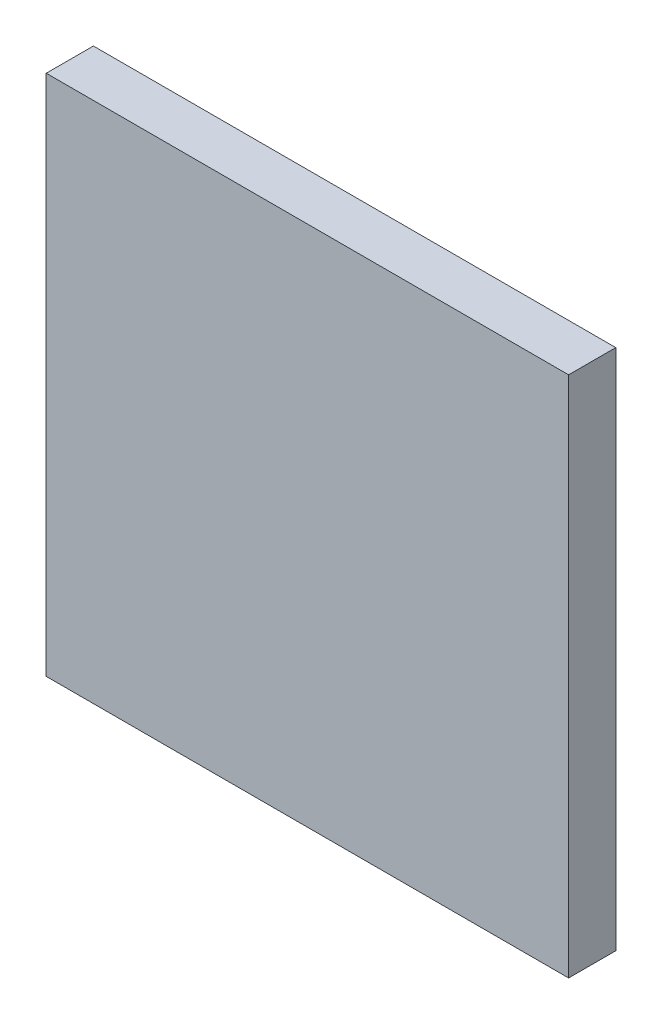
ISO-10303-21;
HEADER;
FILE_DESCRIPTION(('STEP AP214'),'2;1');
FILE_NAME('part.step','',(''),(''),'','','');
FILE_SCHEMA(('AUTOMOTIVE_DESIGN { 1 0 10303 214 1 1 1 1 }'));
ENDSEC;
DATA;
#1=APPLICATION_CONTEXT('core data for automotive mechanical design processes');
#2=APPLICATION_PROTOCOL_DEFINITION('international standard','automotive_design',2000,#1);
#3=PRODUCT_CONTEXT('',#1,'mechanical');
#4=PRODUCT('Part','Part','',(#3));
#5=PRODUCT_RELATED_PRODUCT_CATEGORY('part','',(#4));
#6=PRODUCT_DEFINITION_FORMATION('','',#4);
#7=PRODUCT_DEFINITION_CONTEXT('part definition',#1,'design');
#8=PRODUCT_DEFINITION('design','',#6,#7);
#9=PRODUCT_DEFINITION_SHAPE('','',#8);
#10=(LENGTH_UNIT() NAMED_UNIT(*) SI_UNIT(.MILLI.,.METRE.));
#11=(NAMED_UNIT(*) PLANE_ANGLE_UNIT() SI_UNIT($,.RADIAN.));
#12=(NAMED_UNIT(*) SI_UNIT($,.STERADIAN.) SOLID_ANGLE_UNIT());
#13=UNCERTAINTY_MEASURE_WITH_UNIT(LENGTH_MEASURE(1.E-05),#10,'distance_accuracy_value','');
#14=(GEOMETRIC_REPRESENTATION_CONTEXT(3) GLOBAL_UNCERTAINTY_ASSIGNED_CONTEXT((#13)) GLOBAL_UNIT_ASSIGNED_CONTEXT((#10,
#11,#12)) REPRESENTATION_CONTEXT('',''));
#15=CARTESIAN_POINT('',(0.,0.,0.));
#16=DIRECTION('',(0.,0.,1.));
#17=DIRECTION('',(1.,0.,0.));
#18=AXIS2_PLACEMENT_3D('',#15,#16,#17);
#19=CARTESIAN_POINT('',(0.,27.7,2.5));
#20=DIRECTION('',(1.,0.,0.));
#21=DIRECTION('',(0.,0.,-1.));
#22=AXIS2_PLACEMENT_3D('',#19,#20,#21);
#23=PLANE('',#22);
#24=DIRECTION('',(0.,-1.,0.));
#25=VECTOR('',#24,1.);
#26=CARTESIAN_POINT('',(0.,27.7,0.));
#27=LINE('',#26,#25);
#28=CARTESIAN_POINT('',(0.,27.7,0.));
#29=VERTEX_POINT('',#28);
#30=CARTESIAN_POINT('',(0.,0.,0.));
#31=VERTEX_POINT('',#30);
#32=EDGE_CURVE('E95',#29,#31,#27,.T.);
#33=ORIENTED_EDGE('',*,*,#32,.T.);
#34=DIRECTION('',(0.,0.,-1.));
#35=VECTOR('',#34,1.);
#36=CARTESIAN_POINT('',(0.,0.,2.5));
#37=LINE('',#36,#35);
#38=CARTESIAN_POINT('',(0.,0.,2.5));
#39=VERTEX_POINT('',#38);
#40=EDGE_CURVE('E11',#39,#31,#37,.T.);
#41=ORIENTED_EDGE('',*,*,#40,.F.);
#42=DIRECTION('',(0.,-1.,0.));
#43=VECTOR('',#42,1.);
#44=CARTESIAN_POINT('',(0.,27.7,2.5));
#45=LINE('',#44,#43);
#46=CARTESIAN_POINT('',(0.,27.7,2.5));
#47=VERTEX_POINT('',#46);
#48=EDGE_CURVE('E83',#47,#39,#45,.T.);
#49=ORIENTED_EDGE('',*,*,#48,.F.);
#50=DIRECTION('',(0.,0.,-1.));
#51=VECTOR('',#50,1.);
#52=CARTESIAN_POINT('',(0.,27.7,2.5));
#53=LINE('',#52,#51);
#54=EDGE_CURVE('E91',#47,#29,#53,.T.);
#55=ORIENTED_EDGE('',*,*,#54,.T.);
#56=EDGE_LOOP('',(#33,#41,#49,#55));
#57=FACE_BOUND('',#56,.T.);
#58=ADVANCED_FACE('F32',(#57),#23,.F.);
#59=CARTESIAN_POINT('',(0.,0.,2.5));
#60=DIRECTION('',(0.,1.,0.));
#61=DIRECTION('',(0.,0.,1.));
#62=AXIS2_PLACEMENT_3D('',#59,#60,#61);
#63=PLANE('',#62);
#64=DIRECTION('',(1.,0.,0.));
#65=VECTOR('',#64,1.);
#66=CARTESIAN_POINT('',(0.,0.,0.));
#67=LINE('',#66,#65);
#68=CARTESIAN_POINT('',(27.7,0.,0.));
#69=VERTEX_POINT('',#68);
#70=EDGE_CURVE('E87',#31,#69,#67,.T.);
#71=ORIENTED_EDGE('',*,*,#70,.T.);
#72=DIRECTION('',(0.,0.,-1.));
#73=VECTOR('',#72,1.);
#74=CARTESIAN_POINT('',(27.7,0.,2.5));
#75=LINE('',#74,#73);
#76=CARTESIAN_POINT('',(27.7,0.,2.5));
#77=VERTEX_POINT('',#76);
#78=EDGE_CURVE('E40',#77,#69,#75,.T.);
#79=ORIENTED_EDGE('',*,*,#78,.F.);
#80=DIRECTION('',(1.,0.,0.));
#81=VECTOR('',#80,1.);
#82=CARTESIAN_POINT('',(0.,0.,2.5));
#83=LINE('',#82,#81);
#84=EDGE_CURVE('E78',#39,#77,#83,.T.);
#85=ORIENTED_EDGE('',*,*,#84,.F.);
#86=ORIENTED_EDGE('',*,*,#40,.T.);
#87=EDGE_LOOP('',(#71,#79,#85,#86));
#88=FACE_BOUND('',#87,.T.);
#89=ADVANCED_FACE('F86',(#88),#63,.F.);
#90=CARTESIAN_POINT('',(27.7,27.7,2.5));
#91=DIRECTION('',(-1.,0.,0.));
#92=DIRECTION('',(0.,0.,1.));
#93=AXIS2_PLACEMENT_3D('',#90,#91,#92);
#94=PLANE('',#93);
#95=DIRECTION('',(0.,1.,0.));
#96=VECTOR('',#95,1.);
#97=CARTESIAN_POINT('',(27.7,27.7,0.));
#98=LINE('',#97,#96);
#99=CARTESIAN_POINT('',(27.7,27.7,0.));
#100=VERTEX_POINT('',#99);
#101=EDGE_CURVE('E65',#69,#100,#98,.T.);
#102=ORIENTED_EDGE('',*,*,#101,.T.);
#103=DIRECTION('',(0.,0.,-1.));
#104=VECTOR('',#103,1.);
#105=CARTESIAN_POINT('',(27.7,27.7,2.5));
#106=LINE('',#105,#104);
#107=CARTESIAN_POINT('',(27.7,27.7,2.5));
#108=VERTEX_POINT('',#107);
#109=EDGE_CURVE('E88',#108,#100,#106,.T.);
#110=ORIENTED_EDGE('',*,*,#109,.F.);
#111=DIRECTION('',(0.,1.,0.));
#112=VECTOR('',#111,1.);
#113=CARTESIAN_POINT('',(27.7,27.7,2.5));
#114=LINE('',#113,#112);
#115=EDGE_CURVE('E81',#77,#108,#114,.T.);
#116=ORIENTED_EDGE('',*,*,#115,.F.);
#117=ORIENTED_EDGE('',*,*,#78,.T.);
#118=EDGE_LOOP('',(#102,#110,#116,#117));
#119=FACE_BOUND('',#118,.T.);
#120=ADVANCED_FACE('F89',(#119),#94,.F.);
#121=CARTESIAN_POINT('',(0.,27.7,2.5));
#122=DIRECTION('',(0.,-1.,0.));
#123=DIRECTION('',(0.,0.,-1.));
#124=AXIS2_PLACEMENT_3D('',#121,#122,#123);
#125=PLANE('',#124);
#126=DIRECTION('',(-1.,0.,0.));
#127=VECTOR('',#126,1.);
#128=CARTESIAN_POINT('',(0.,27.7,0.));
#129=LINE('',#128,#127);
#130=EDGE_CURVE('E71',#100,#29,#129,.T.);
#131=ORIENTED_EDGE('',*,*,#130,.T.);
#132=ORIENTED_EDGE('',*,*,#54,.F.);
#133=DIRECTION('',(-1.,0.,0.));
#134=VECTOR('',#133,1.);
#135=CARTESIAN_POINT('',(0.,27.7,2.5));
#136=LINE('',#135,#134);
#137=EDGE_CURVE('E48',#108,#47,#136,.T.);
#138=ORIENTED_EDGE('',*,*,#137,.F.);
#139=ORIENTED_EDGE('',*,*,#109,.T.);
#140=EDGE_LOOP('',(#131,#132,#138,#139));
#141=FACE_BOUND('',#140,.T.);
#142=ADVANCED_FACE('F102',(#141),#125,.F.);
#143=CARTESIAN_POINT('',(0.,0.,2.5));
#144=DIRECTION('',(0.,0.,1.));
#145=DIRECTION('',(1.,0.,0.));
#146=AXIS2_PLACEMENT_3D('',#143,#144,#145);
#147=PLANE('',#146);
#148=ORIENTED_EDGE('',*,*,#48,.T.);
#149=ORIENTED_EDGE('',*,*,#84,.T.);
#150=ORIENTED_EDGE('',*,*,#115,.T.);
#151=ORIENTED_EDGE('',*,*,#137,.T.);
#152=EDGE_LOOP('',(#148,#149,#150,#151));
#153=FACE_BOUND('',#152,.T.);
#154=ADVANCED_FACE('F79',(#153),#147,.T.);
#155=CARTESIAN_POINT('',(0.,0.,0.));
#156=DIRECTION('',(0.,0.,1.));
#157=DIRECTION('',(1.,0.,0.));
#158=AXIS2_PLACEMENT_3D('',#155,#156,#157);
#159=PLANE('',#158);
#160=ORIENTED_EDGE('',*,*,#32,.F.);
#161=ORIENTED_EDGE('',*,*,#130,.F.);
#162=ORIENTED_EDGE('',*,*,#101,.F.);
#163=ORIENTED_EDGE('',*,*,#70,.F.);
#164=EDGE_LOOP('',(#160,#161,#162,#163));
#165=FACE_BOUND('',#164,.T.);
#166=ADVANCED_FACE('F105',(#165),#159,.F.);
#167=CLOSED_SHELL('',(#58,#89,#120,#142,#154,#166));
#168=MANIFOLD_SOLID_BREP('B2',#167);
#169=ADVANCED_BREP_SHAPE_REPRESENTATION('',(#18,#168),#14);
#170=SHAPE_DEFINITION_REPRESENTATION(#9,#169);
ENDSEC;
END-ISO-10303-21;
